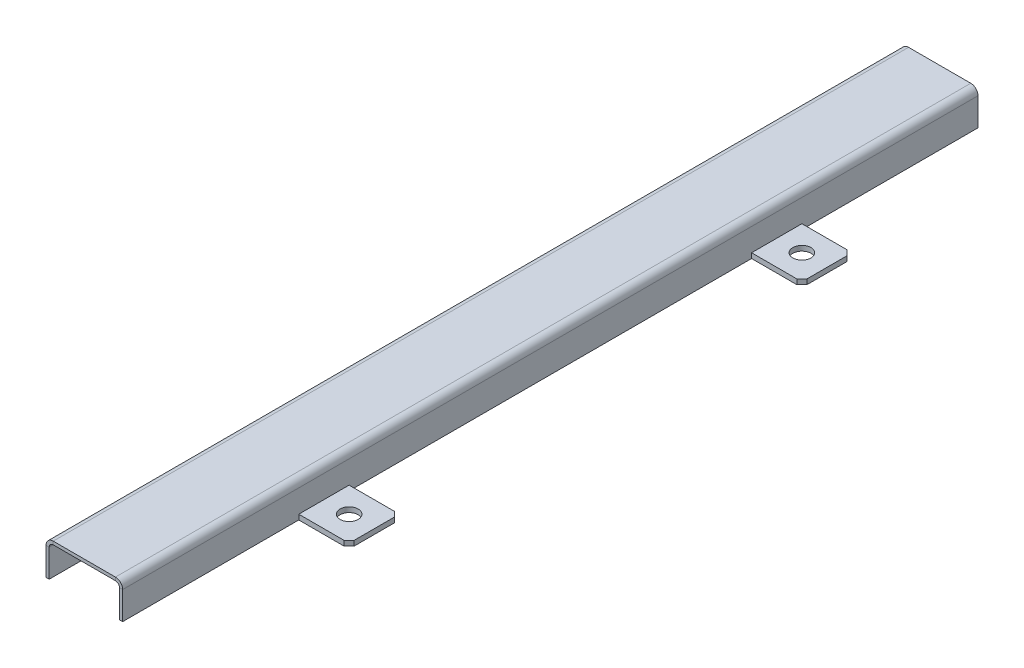
ISO-10303-21;
HEADER;
FILE_DESCRIPTION(('STEP AP214'),'2;1');
FILE_NAME('part.step','',(''),(''),'','','');
FILE_SCHEMA(('AUTOMOTIVE_DESIGN { 1 0 10303 214 1 1 1 1 }'));
ENDSEC;
DATA;
#1=APPLICATION_CONTEXT('core data for automotive mechanical design processes');
#2=APPLICATION_PROTOCOL_DEFINITION('international standard','automotive_design',2000,#1);
#3=PRODUCT_CONTEXT('',#1,'mechanical');
#4=PRODUCT('Part','Part','',(#3));
#5=PRODUCT_RELATED_PRODUCT_CATEGORY('part','',(#4));
#6=PRODUCT_DEFINITION_FORMATION('','',#4);
#7=PRODUCT_DEFINITION_CONTEXT('part definition',#1,'design');
#8=PRODUCT_DEFINITION('design','',#6,#7);
#9=PRODUCT_DEFINITION_SHAPE('','',#8);
#10=(LENGTH_UNIT() NAMED_UNIT(*) SI_UNIT(.MILLI.,.METRE.));
#11=(NAMED_UNIT(*) PLANE_ANGLE_UNIT() SI_UNIT($,.RADIAN.));
#12=(NAMED_UNIT(*) SI_UNIT($,.STERADIAN.) SOLID_ANGLE_UNIT());
#13=UNCERTAINTY_MEASURE_WITH_UNIT(LENGTH_MEASURE(1.E-05),#10,'distance_accuracy_value','');
#14=(GEOMETRIC_REPRESENTATION_CONTEXT(3) GLOBAL_UNCERTAINTY_ASSIGNED_CONTEXT((#13)) GLOBAL_UNIT_ASSIGNED_CONTEXT((#10,
#11,#12)) REPRESENTATION_CONTEXT('',''));
#15=CARTESIAN_POINT('',(0.,0.,0.));
#16=DIRECTION('',(0.,0.,1.));
#17=DIRECTION('',(1.,0.,0.));
#18=AXIS2_PLACEMENT_3D('',#15,#16,#17);
#19=CARTESIAN_POINT('',(140.,34.8,425.));
#20=DIRECTION('',(1.,0.,0.));
#21=DIRECTION('',(0.,0.,-1.));
#22=AXIS2_PLACEMENT_3D('',#19,#20,#21);
#23=PLANE('',#22);
#24=DIRECTION('',(0.,-1.,0.));
#25=VECTOR('',#24,1.);
#26=CARTESIAN_POINT('',(140.,0.,-250.));
#27=LINE('',#26,#25);
#28=CARTESIAN_POINT('',(140.,5.00000000000002,-250.));
#29=VERTEX_POINT('',#28);
#30=CARTESIAN_POINT('',(140.,0.,-250.));
#31=VERTEX_POINT('',#30);
#32=EDGE_CURVE('E219',#29,#31,#27,.T.);
#33=ORIENTED_EDGE('',*,*,#32,.T.);
#34=DIRECTION('',(0.,0.,-1.));
#35=VECTOR('',#34,1.);
#36=CARTESIAN_POINT('',(140.,0.,425.));
#37=LINE('',#36,#35);
#38=CARTESIAN_POINT('',(140.,0.,-425.));
#39=VERTEX_POINT('',#38);
#40=EDGE_CURVE('E226',#31,#39,#37,.T.);
#41=ORIENTED_EDGE('',*,*,#40,.T.);
#42=DIRECTION('',(0.,-1.,0.));
#43=VECTOR('',#42,1.);
#44=CARTESIAN_POINT('',(140.,34.8,-425.));
#45=LINE('',#44,#43);
#46=CARTESIAN_POINT('',(140.,27.625,-425.));
#47=VERTEX_POINT('',#46);
#48=EDGE_CURVE('E361',#47,#39,#45,.T.);
#49=ORIENTED_EDGE('',*,*,#48,.F.);
#50=DIRECTION('',(0.,0.,-1.));
#51=VECTOR('',#50,1.);
#52=CARTESIAN_POINT('',(140.,27.625,425.));
#53=LINE('',#52,#51);
#54=CARTESIAN_POINT('',(140.,27.625,425.));
#55=VERTEX_POINT('',#54);
#56=EDGE_CURVE('E235',#55,#47,#53,.T.);
#57=ORIENTED_EDGE('',*,*,#56,.F.);
#58=DIRECTION('',(0.,-1.,0.));
#59=VECTOR('',#58,1.);
#60=CARTESIAN_POINT('',(140.,34.8,425.));
#61=LINE('',#60,#59);
#62=CARTESIAN_POINT('',(140.,0.,425.));
#63=VERTEX_POINT('',#62);
#64=EDGE_CURVE('E315',#55,#63,#61,.T.);
#65=ORIENTED_EDGE('',*,*,#64,.T.);
#66=CARTESIAN_POINT('',(140.,0.,250.));
#67=VERTEX_POINT('',#66);
#68=EDGE_CURVE('E237',#63,#67,#37,.T.);
#69=ORIENTED_EDGE('',*,*,#68,.T.);
#70=DIRECTION('',(0.,-1.,0.));
#71=VECTOR('',#70,1.);
#72=CARTESIAN_POINT('',(140.,0.,250.));
#73=LINE('',#72,#71);
#74=CARTESIAN_POINT('',(140.,5.00000000000001,250.));
#75=VERTEX_POINT('',#74);
#76=EDGE_CURVE('E274',#75,#67,#73,.T.);
#77=ORIENTED_EDGE('',*,*,#76,.F.);
#78=DIRECTION('',(0.,0.,1.));
#79=VECTOR('',#78,1.);
#80=CARTESIAN_POINT('',(140.,5.00000000000001,250.));
#81=LINE('',#80,#79);
#82=CARTESIAN_POINT('',(140.,5.00000000000002,200.));
#83=VERTEX_POINT('',#82);
#84=EDGE_CURVE('E280',#83,#75,#81,.T.);
#85=ORIENTED_EDGE('',*,*,#84,.F.);
#86=DIRECTION('',(0.,1.,0.));
#87=VECTOR('',#86,1.);
#88=CARTESIAN_POINT('',(140.,0.,200.));
#89=LINE('',#88,#87);
#90=CARTESIAN_POINT('',(140.,0.,200.));
#91=VERTEX_POINT('',#90);
#92=EDGE_CURVE('E288',#91,#83,#89,.T.);
#93=ORIENTED_EDGE('',*,*,#92,.F.);
#94=CARTESIAN_POINT('',(140.,0.,-200.));
#95=VERTEX_POINT('',#94);
#96=EDGE_CURVE('E234',#91,#95,#37,.T.);
#97=ORIENTED_EDGE('',*,*,#96,.T.);
#98=DIRECTION('',(0.,1.,0.));
#99=VECTOR('',#98,1.);
#100=CARTESIAN_POINT('',(140.,0.,-200.));
#101=LINE('',#100,#99);
#102=CARTESIAN_POINT('',(140.,5.00000000000002,-200.));
#103=VERTEX_POINT('',#102);
#104=EDGE_CURVE('E247',#95,#103,#101,.T.);
#105=ORIENTED_EDGE('',*,*,#104,.T.);
#106=DIRECTION('',(0.,0.,-1.));
#107=VECTOR('',#106,1.);
#108=CARTESIAN_POINT('',(140.,5.00000000000001,-250.));
#109=LINE('',#108,#107);
#110=EDGE_CURVE('E241',#103,#29,#109,.T.);
#111=ORIENTED_EDGE('',*,*,#110,.T.);
#112=EDGE_LOOP('',(#33,#41,#49,#57,#65,#69,#77,#85,#93,#97,#105,#111));
#113=FACE_BOUND('',#112,.T.);
#114=ADVANCED_FACE('F49',(#113),#23,.T.);
#115=CARTESIAN_POINT('',(70.975,34.8,425.));
#116=DIRECTION('',(0.,0.,1.));
#117=DIRECTION('',(1.,0.,0.));
#118=AXIS2_PLACEMENT_3D('',#115,#116,#117);
#119=PLANE('',#118);
#120=DIRECTION('',(0.,-1.,0.));
#121=VECTOR('',#120,1.);
#122=CARTESIAN_POINT('',(70.975,34.8,425.));
#123=LINE('',#122,#121);
#124=CARTESIAN_POINT('',(70.975,34.8,425.));
#125=VERTEX_POINT('',#124);
#126=CARTESIAN_POINT('',(70.975,31.625,425.));
#127=VERTEX_POINT('',#126);
#128=EDGE_CURVE('E461',#125,#127,#123,.T.);
#129=ORIENTED_EDGE('',*,*,#128,.F.);
#130=CARTESIAN_POINT('',(70.975,27.625,425.));
#131=DIRECTION('',(0.,0.,1.));
#132=DIRECTION('',(1.,0.,0.));
#133=AXIS2_PLACEMENT_3D('',#130,#131,#132);
#134=CIRCLE('',#133,7.175);
#135=CARTESIAN_POINT('',(63.8,27.625,425.));
#136=VERTEX_POINT('',#135);
#137=EDGE_CURVE('E327',#136,#125,#134,.F.);
#138=ORIENTED_EDGE('',*,*,#137,.F.);
#139=DIRECTION('',(-1.,0.,0.));
#140=VECTOR('',#139,1.);
#141=CARTESIAN_POINT('',(66.975,27.625,425.));
#142=LINE('',#141,#140);
#143=CARTESIAN_POINT('',(66.975,27.625,425.));
#144=VERTEX_POINT('',#143);
#145=EDGE_CURVE('E458',#144,#136,#142,.T.);
#146=ORIENTED_EDGE('',*,*,#145,.F.);
#147=CARTESIAN_POINT('',(70.975,27.625,425.));
#148=DIRECTION('',(0.,0.,1.));
#149=DIRECTION('',(1.,0.,0.));
#150=AXIS2_PLACEMENT_3D('',#147,#148,#149);
#151=CIRCLE('',#150,4.);
#152=EDGE_CURVE('E343',#144,#127,#151,.F.);
#153=ORIENTED_EDGE('',*,*,#152,.T.);
#154=EDGE_LOOP('',(#129,#138,#146,#153));
#155=FACE_BOUND('',#154,.T.);
#156=ADVANCED_FACE('F541',(#155),#119,.T.);
#157=CARTESIAN_POINT('',(66.975,27.625,425.));
#158=DIRECTION('',(0.,0.,1.));
#159=DIRECTION('',(1.,0.,0.));
#160=AXIS2_PLACEMENT_3D('',#157,#158,#159);
#161=PLANE('',#160);
#162=DIRECTION('',(1.,0.,0.));
#163=VECTOR('',#162,1.);
#164=CARTESIAN_POINT('',(63.8,34.8,425.));
#165=LINE('',#164,#163);
#166=CARTESIAN_POINT('',(132.825,34.8,425.));
#167=VERTEX_POINT('',#166);
#168=EDGE_CURVE('E323',#125,#167,#165,.T.);
#169=ORIENTED_EDGE('',*,*,#168,.F.);
#170=ORIENTED_EDGE('',*,*,#128,.T.);
#171=DIRECTION('',(1.,0.,0.));
#172=VECTOR('',#171,1.);
#173=CARTESIAN_POINT('',(63.8,31.625,425.));
#174=LINE('',#173,#172);
#175=CARTESIAN_POINT('',(132.825,31.625,425.));
#176=VERTEX_POINT('',#175);
#177=EDGE_CURVE('E347',#127,#176,#174,.T.);
#178=ORIENTED_EDGE('',*,*,#177,.T.);
#179=DIRECTION('',(0.,1.,0.));
#180=VECTOR('',#179,1.);
#181=CARTESIAN_POINT('',(132.825,31.625,425.));
#182=LINE('',#181,#180);
#183=EDGE_CURVE('E446',#176,#167,#182,.T.);
#184=ORIENTED_EDGE('',*,*,#183,.T.);
#185=EDGE_LOOP('',(#169,#170,#178,#184));
#186=FACE_BOUND('',#185,.T.);
#187=ADVANCED_FACE('F546',(#186),#161,.T.);
#188=CARTESIAN_POINT('',(63.8,27.625,-425.));
#189=DIRECTION('',(0.,0.,-1.));
#190=DIRECTION('',(-1.,0.,0.));
#191=AXIS2_PLACEMENT_3D('',#188,#189,#190);
#192=PLANE('',#191);
#193=DIRECTION('',(1.,0.,0.));
#194=VECTOR('',#193,1.);
#195=CARTESIAN_POINT('',(63.8,27.625,-425.));
#196=LINE('',#195,#194);
#197=CARTESIAN_POINT('',(63.8,27.625,-425.));
#198=VERTEX_POINT('',#197);
#199=CARTESIAN_POINT('',(66.975,27.625,-425.));
#200=VERTEX_POINT('',#199);
#201=EDGE_CURVE('E455',#198,#200,#196,.T.);
#202=ORIENTED_EDGE('',*,*,#201,.F.);
#203=CARTESIAN_POINT('',(70.975,27.625,-425.));
#204=DIRECTION('',(0.,0.,1.));
#205=DIRECTION('',(1.,0.,0.));
#206=AXIS2_PLACEMENT_3D('',#203,#204,#205);
#207=CIRCLE('',#206,7.175);
#208=CARTESIAN_POINT('',(70.975,34.8,-425.));
#209=VERTEX_POINT('',#208);
#210=EDGE_CURVE('E372',#198,#209,#207,.F.);
#211=ORIENTED_EDGE('',*,*,#210,.T.);
#212=DIRECTION('',(0.,1.,0.));
#213=VECTOR('',#212,1.);
#214=CARTESIAN_POINT('',(70.975,31.625,-425.));
#215=LINE('',#214,#213);
#216=CARTESIAN_POINT('',(70.975,31.625,-425.));
#217=VERTEX_POINT('',#216);
#218=EDGE_CURVE('E452',#217,#209,#215,.T.);
#219=ORIENTED_EDGE('',*,*,#218,.F.);
#220=CARTESIAN_POINT('',(70.975,27.625,-425.));
#221=DIRECTION('',(0.,0.,1.));
#222=DIRECTION('',(1.,0.,0.));
#223=AXIS2_PLACEMENT_3D('',#220,#221,#222);
#224=CIRCLE('',#223,4.);
#225=EDGE_CURVE('E388',#200,#217,#224,.F.);
#226=ORIENTED_EDGE('',*,*,#225,.F.);
#227=EDGE_LOOP('',(#202,#211,#219,#226));
#228=FACE_BOUND('',#227,.T.);
#229=ADVANCED_FACE('F579',(#228),#192,.T.);
#230=CARTESIAN_POINT('',(70.975,31.625,-425.));
#231=DIRECTION('',(0.,0.,-1.));
#232=DIRECTION('',(-1.,0.,0.));
#233=AXIS2_PLACEMENT_3D('',#230,#231,#232);
#234=PLANE('',#233);
#235=DIRECTION('',(0.,1.,0.));
#236=VECTOR('',#235,1.);
#237=CARTESIAN_POINT('',(63.8,0.,-425.));
#238=LINE('',#237,#236);
#239=CARTESIAN_POINT('',(63.8,0.,-425.));
#240=VERTEX_POINT('',#239);
#241=EDGE_CURVE('E376',#240,#198,#238,.T.);
#242=ORIENTED_EDGE('',*,*,#241,.T.);
#243=ORIENTED_EDGE('',*,*,#201,.T.);
#244=DIRECTION('',(0.,1.,0.));
#245=VECTOR('',#244,1.);
#246=CARTESIAN_POINT('',(66.975,0.,-425.));
#247=LINE('',#246,#245);
#248=CARTESIAN_POINT('',(66.975,0.,-425.));
#249=VERTEX_POINT('',#248);
#250=EDGE_CURVE('E384',#249,#200,#247,.T.);
#251=ORIENTED_EDGE('',*,*,#250,.F.);
#252=DIRECTION('',(-1.,0.,0.));
#253=VECTOR('',#252,1.);
#254=CARTESIAN_POINT('',(66.975,0.,-425.));
#255=LINE('',#254,#253);
#256=EDGE_CURVE('E380',#249,#240,#255,.T.);
#257=ORIENTED_EDGE('',*,*,#256,.T.);
#258=EDGE_LOOP('',(#242,#243,#251,#257));
#259=FACE_BOUND('',#258,.T.);
#260=ADVANCED_FACE('F575',(#259),#234,.T.);
#261=CARTESIAN_POINT('',(140.,27.625,425.));
#262=DIRECTION('',(0.,0.,1.));
#263=DIRECTION('',(1.,0.,0.));
#264=AXIS2_PLACEMENT_3D('',#261,#262,#263);
#265=PLANE('',#264);
#266=DIRECTION('',(-1.,0.,0.));
#267=VECTOR('',#266,1.);
#268=CARTESIAN_POINT('',(140.,27.625,425.));
#269=LINE('',#268,#267);
#270=CARTESIAN_POINT('',(136.825,27.625,425.));
#271=VERTEX_POINT('',#270);
#272=EDGE_CURVE('E449',#55,#271,#269,.T.);
#273=ORIENTED_EDGE('',*,*,#272,.F.);
#274=CARTESIAN_POINT('',(132.825,27.625,425.));
#275=DIRECTION('',(0.,0.,1.));
#276=DIRECTION('',(1.,0.,0.));
#277=AXIS2_PLACEMENT_3D('',#274,#275,#276);
#278=CIRCLE('',#277,7.175);
#279=EDGE_CURVE('E319',#167,#55,#278,.F.);
#280=ORIENTED_EDGE('',*,*,#279,.F.);
#281=ORIENTED_EDGE('',*,*,#183,.F.);
#282=CARTESIAN_POINT('',(132.825,27.625,425.));
#283=DIRECTION('',(0.,0.,1.));
#284=DIRECTION('',(1.,0.,0.));
#285=AXIS2_PLACEMENT_3D('',#282,#283,#284);
#286=CIRCLE('',#285,4.);
#287=EDGE_CURVE('E351',#176,#271,#286,.F.);
#288=ORIENTED_EDGE('',*,*,#287,.T.);
#289=EDGE_LOOP('',(#273,#280,#281,#288));
#290=FACE_BOUND('',#289,.T.);
#291=ADVANCED_FACE('F571',(#290),#265,.T.);
#292=CARTESIAN_POINT('',(132.825,31.625,425.));
#293=DIRECTION('',(0.,0.,1.));
#294=DIRECTION('',(1.,0.,0.));
#295=AXIS2_PLACEMENT_3D('',#292,#293,#294);
#296=PLANE('',#295);
#297=ORIENTED_EDGE('',*,*,#64,.F.);
#298=ORIENTED_EDGE('',*,*,#272,.T.);
#299=DIRECTION('',(0.,1.,0.));
#300=VECTOR('',#299,1.);
#301=CARTESIAN_POINT('',(136.825,34.8,425.));
#302=LINE('',#301,#300);
#303=CARTESIAN_POINT('',(136.825,0.,425.));
#304=VERTEX_POINT('',#303);
#305=EDGE_CURVE('E307',#271,#304,#302,.F.);
#306=ORIENTED_EDGE('',*,*,#305,.T.);
#307=DIRECTION('',(-1.,0.,0.));
#308=VECTOR('',#307,1.);
#309=CARTESIAN_POINT('',(140.,0.,425.));
#310=LINE('',#309,#308);
#311=EDGE_CURVE('E310',#63,#304,#310,.T.);
#312=ORIENTED_EDGE('',*,*,#311,.F.);
#313=EDGE_LOOP('',(#297,#298,#306,#312));
#314=FACE_BOUND('',#313,.T.);
#315=ADVANCED_FACE('F567',(#314),#296,.T.);
#316=CARTESIAN_POINT('',(132.825,34.8,-425.));
#317=DIRECTION('',(0.,0.,-1.));
#318=DIRECTION('',(-1.,0.,0.));
#319=AXIS2_PLACEMENT_3D('',#316,#317,#318);
#320=PLANE('',#319);
#321=DIRECTION('',(0.,-1.,0.));
#322=VECTOR('',#321,1.);
#323=CARTESIAN_POINT('',(132.825,34.8,-425.));
#324=LINE('',#323,#322);
#325=CARTESIAN_POINT('',(132.825,34.8,-425.));
#326=VERTEX_POINT('',#325);
#327=CARTESIAN_POINT('',(132.825,31.625,-425.));
#328=VERTEX_POINT('',#327);
#329=EDGE_CURVE('E443',#326,#328,#324,.T.);
#330=ORIENTED_EDGE('',*,*,#329,.F.);
#331=CARTESIAN_POINT('',(132.825,27.625,-425.));
#332=DIRECTION('',(0.,0.,1.));
#333=DIRECTION('',(1.,0.,0.));
#334=AXIS2_PLACEMENT_3D('',#331,#332,#333);
#335=CIRCLE('',#334,7.175);
#336=EDGE_CURVE('E364',#326,#47,#335,.F.);
#337=ORIENTED_EDGE('',*,*,#336,.T.);
#338=DIRECTION('',(1.,0.,0.));
#339=VECTOR('',#338,1.);
#340=CARTESIAN_POINT('',(136.825,27.625,-425.));
#341=LINE('',#340,#339);
#342=CARTESIAN_POINT('',(136.825,27.625,-425.));
#343=VERTEX_POINT('',#342);
#344=EDGE_CURVE('E440',#343,#47,#341,.T.);
#345=ORIENTED_EDGE('',*,*,#344,.F.);
#346=CARTESIAN_POINT('',(132.825,27.625,-425.));
#347=DIRECTION('',(0.,0.,1.));
#348=DIRECTION('',(1.,0.,0.));
#349=AXIS2_PLACEMENT_3D('',#346,#347,#348);
#350=CIRCLE('',#349,4.);
#351=EDGE_CURVE('E311',#328,#343,#350,.F.);
#352=ORIENTED_EDGE('',*,*,#351,.F.);
#353=EDGE_LOOP('',(#330,#337,#345,#352));
#354=FACE_BOUND('',#353,.T.);
#355=ADVANCED_FACE('F563',(#354),#320,.T.);
#356=CARTESIAN_POINT('',(136.825,27.625,-425.));
#357=DIRECTION('',(0.,0.,-1.));
#358=DIRECTION('',(-1.,0.,0.));
#359=AXIS2_PLACEMENT_3D('',#356,#357,#358);
#360=PLANE('',#359);
#361=DIRECTION('',(1.,0.,0.));
#362=VECTOR('',#361,1.);
#363=CARTESIAN_POINT('',(63.8,34.8,-425.));
#364=LINE('',#363,#362);
#365=EDGE_CURVE('E368',#209,#326,#364,.T.);
#366=ORIENTED_EDGE('',*,*,#365,.T.);
#367=ORIENTED_EDGE('',*,*,#329,.T.);
#368=DIRECTION('',(1.,0.,0.));
#369=VECTOR('',#368,1.);
#370=CARTESIAN_POINT('',(63.8,31.625,-425.));
#371=LINE('',#370,#369);
#372=EDGE_CURVE('E392',#217,#328,#371,.T.);
#373=ORIENTED_EDGE('',*,*,#372,.F.);
#374=ORIENTED_EDGE('',*,*,#218,.T.);
#375=EDGE_LOOP('',(#366,#367,#373,#374));
#376=FACE_BOUND('',#375,.T.);
#377=ADVANCED_FACE('F559',(#376),#360,.T.);
#378=CARTESIAN_POINT('',(136.825,34.8,425.));
#379=DIRECTION('',(1.,0.,0.));
#380=DIRECTION('',(0.,0.,-1.));
#381=AXIS2_PLACEMENT_3D('',#378,#379,#380);
#382=PLANE('',#381);
#383=DIRECTION('',(0.,1.,0.));
#384=VECTOR('',#383,1.);
#385=CARTESIAN_POINT('',(136.825,34.8,-425.));
#386=LINE('',#385,#384);
#387=CARTESIAN_POINT('',(136.825,0.,-425.));
#388=VERTEX_POINT('',#387);
#389=EDGE_CURVE('E306',#343,#388,#386,.F.);
#390=ORIENTED_EDGE('',*,*,#389,.T.);
#391=DIRECTION('',(0.,0.,-1.));
#392=VECTOR('',#391,1.);
#393=CARTESIAN_POINT('',(136.825,0.,425.));
#394=LINE('',#393,#392);
#395=EDGE_CURVE('E437',#304,#388,#394,.T.);
#396=ORIENTED_EDGE('',*,*,#395,.F.);
#397=ORIENTED_EDGE('',*,*,#305,.F.);
#398=DIRECTION('',(0.,0.,-1.));
#399=VECTOR('',#398,1.);
#400=CARTESIAN_POINT('',(136.825,27.625,425.));
#401=LINE('',#400,#399);
#402=EDGE_CURVE('E355',#271,#343,#401,.T.);
#403=ORIENTED_EDGE('',*,*,#402,.T.);
#404=EDGE_LOOP('',(#390,#396,#397,#403));
#405=FACE_BOUND('',#404,.T.);
#406=ADVANCED_FACE('F555',(#405),#382,.F.);
#407=CARTESIAN_POINT('',(140.,0.,425.));
#408=DIRECTION('',(0.,-1.,0.));
#409=DIRECTION('',(0.,0.,-1.));
#410=AXIS2_PLACEMENT_3D('',#407,#408,#409);
#411=PLANE('',#410);
#412=CARTESIAN_POINT('',(165.,0.,-225.));
#413=DIRECTION('',(0.,-1.,0.));
#414=DIRECTION('',(0.,0.,-1.));
#415=AXIS2_PLACEMENT_3D('',#412,#413,#414);
#416=CIRCLE('',#415,9.00000000000001);
#417=CARTESIAN_POINT('',(165.,0.,-234.));
#418=VERTEX_POINT('',#417);
#419=EDGE_CURVE('E243',#418,#418,#416,.F.);
#420=ORIENTED_EDGE('',*,*,#419,.T.);
#421=EDGE_LOOP('',(#420));
#422=FACE_BOUND('',#421,.T.);
#423=CARTESIAN_POINT('',(165.,0.,225.));
#424=DIRECTION('',(0.,-1.,0.));
#425=DIRECTION('',(0.,0.,-1.));
#426=AXIS2_PLACEMENT_3D('',#423,#424,#425);
#427=CIRCLE('',#426,9.00000000000001);
#428=CARTESIAN_POINT('',(165.,0.,216.));
#429=VERTEX_POINT('',#428);
#430=EDGE_CURVE('E270',#429,#429,#427,.T.);
#431=ORIENTED_EDGE('',*,*,#430,.F.);
#432=EDGE_LOOP('',(#431));
#433=FACE_BOUND('',#432,.T.);
#434=DIRECTION('',(0.,0.,1.));
#435=VECTOR('',#434,1.);
#436=CARTESIAN_POINT('',(190.,0.,-250.));
#437=LINE('',#436,#435);
#438=CARTESIAN_POINT('',(190.,0.,-245.));
#439=VERTEX_POINT('',#438);
#440=CARTESIAN_POINT('',(190.,0.,-205.));
#441=VERTEX_POINT('',#440);
#442=EDGE_CURVE('E223',#439,#441,#437,.T.);
#443=ORIENTED_EDGE('',*,*,#442,.T.);
#444=DIRECTION('',(-0.707106781186548,0.,0.707106781186548));
#445=VECTOR('',#444,1.);
#446=CARTESIAN_POINT('',(-150.,0.,135.));
#447=LINE('',#446,#445);
#448=CARTESIAN_POINT('',(185.,0.,-200.));
#449=VERTEX_POINT('',#448);
#450=EDGE_CURVE('E59',#441,#449,#447,.T.);
#451=ORIENTED_EDGE('',*,*,#450,.T.);
#452=DIRECTION('',(-1.,0.,0.));
#453=VECTOR('',#452,1.);
#454=CARTESIAN_POINT('',(190.,0.,-200.));
#455=LINE('',#454,#453);
#456=EDGE_CURVE('E222',#449,#95,#455,.T.);
#457=ORIENTED_EDGE('',*,*,#456,.T.);
#458=ORIENTED_EDGE('',*,*,#96,.F.);
#459=DIRECTION('',(-1.,0.,0.));
#460=VECTOR('',#459,1.);
#461=CARTESIAN_POINT('',(190.,0.,200.));
#462=LINE('',#461,#460);
#463=CARTESIAN_POINT('',(185.,0.,200.));
#464=VERTEX_POINT('',#463);
#465=EDGE_CURVE('E300',#464,#91,#462,.T.);
#466=ORIENTED_EDGE('',*,*,#465,.F.);
#467=DIRECTION('',(-0.707106781186548,0.,-0.707106781186548));
#468=VECTOR('',#467,1.);
#469=CARTESIAN_POINT('',(275.,0.,290.));
#470=LINE('',#469,#468);
#471=CARTESIAN_POINT('',(190.,0.,205.));
#472=VERTEX_POINT('',#471);
#473=EDGE_CURVE('E484',#464,#472,#470,.F.);
#474=ORIENTED_EDGE('',*,*,#473,.T.);
#475=DIRECTION('',(0.,0.,-1.));
#476=VECTOR('',#475,1.);
#477=CARTESIAN_POINT('',(190.,0.,250.));
#478=LINE('',#477,#476);
#479=CARTESIAN_POINT('',(190.,0.,245.));
#480=VERTEX_POINT('',#479);
#481=EDGE_CURVE('E275',#480,#472,#478,.T.);
#482=ORIENTED_EDGE('',*,*,#481,.F.);
#483=DIRECTION('',(0.707106781186555,0.,-0.70710678118654));
#484=VECTOR('',#483,1.);
#485=CARTESIAN_POINT('',(74.9999999999994,0.,359.999999999998));
#486=LINE('',#485,#484);
#487=CARTESIAN_POINT('',(185.,0.,250.));
#488=VERTEX_POINT('',#487);
#489=EDGE_CURVE('E481',#480,#488,#486,.F.);
#490=ORIENTED_EDGE('',*,*,#489,.T.);
#491=DIRECTION('',(-1.,0.,0.));
#492=VECTOR('',#491,1.);
#493=CARTESIAN_POINT('',(190.,0.,250.));
#494=LINE('',#493,#492);
#495=EDGE_CURVE('E303',#488,#67,#494,.T.);
#496=ORIENTED_EDGE('',*,*,#495,.T.);
#497=ORIENTED_EDGE('',*,*,#68,.F.);
#498=ORIENTED_EDGE('',*,*,#311,.T.);
#499=ORIENTED_EDGE('',*,*,#395,.T.);
#500=DIRECTION('',(-1.,0.,0.));
#501=VECTOR('',#500,1.);
#502=CARTESIAN_POINT('',(140.,0.,-425.));
#503=LINE('',#502,#501);
#504=EDGE_CURVE('E229',#39,#388,#503,.T.);
#505=ORIENTED_EDGE('',*,*,#504,.F.);
#506=ORIENTED_EDGE('',*,*,#40,.F.);
#507=DIRECTION('',(-1.,0.,0.));
#508=VECTOR('',#507,1.);
#509=CARTESIAN_POINT('',(190.,0.,-250.));
#510=LINE('',#509,#508);
#511=CARTESIAN_POINT('',(185.,0.,-250.));
#512=VERTEX_POINT('',#511);
#513=EDGE_CURVE('E214',#512,#31,#510,.T.);
#514=ORIENTED_EDGE('',*,*,#513,.F.);
#515=DIRECTION('',(0.707106781186555,0.,0.70710678118654));
#516=VECTOR('',#515,1.);
#517=CARTESIAN_POINT('',(499.999999999999,0.,64.9999999999927));
#518=LINE('',#517,#516);
#519=EDGE_CURVE('E66',#512,#439,#518,.T.);
#520=ORIENTED_EDGE('',*,*,#519,.T.);
#521=EDGE_LOOP('',(#443,#451,#457,#458,#466,#474,#482,#490,#496,#497,#498,#499,#505,#506,#514,#520));
#522=FACE_BOUND('',#521,.T.);
#523=ADVANCED_FACE('F227',(#422,#433,#522),#411,.T.);
#524=CARTESIAN_POINT('',(132.825,27.625,425.));
#525=DIRECTION('',(0.,0.,-1.));
#526=DIRECTION('',(-1.,0.,0.));
#527=AXIS2_PLACEMENT_3D('',#524,#525,#526);
#528=CYLINDRICAL_SURFACE('',#527,7.175);
#529=ORIENTED_EDGE('',*,*,#336,.F.);
#530=DIRECTION('',(0.,0.,-1.));
#531=VECTOR('',#530,1.);
#532=CARTESIAN_POINT('',(132.825,34.8,425.));
#533=LINE('',#532,#531);
#534=EDGE_CURVE('E428',#167,#326,#533,.T.);
#535=ORIENTED_EDGE('',*,*,#534,.F.);
#536=ORIENTED_EDGE('',*,*,#279,.T.);
#537=ORIENTED_EDGE('',*,*,#56,.T.);
#538=EDGE_LOOP('',(#529,#535,#536,#537));
#539=FACE_BOUND('',#538,.T.);
#540=ADVANCED_FACE('F551',(#539),#528,.T.);
#541=CARTESIAN_POINT('',(63.8,34.8,425.));
#542=DIRECTION('',(0.,1.,0.));
#543=DIRECTION('',(-1.,0.,0.));
#544=AXIS2_PLACEMENT_3D('',#541,#542,#543);
#545=PLANE('',#544);
#546=ORIENTED_EDGE('',*,*,#365,.F.);
#547=DIRECTION('',(0.,0.,-1.));
#548=VECTOR('',#547,1.);
#549=CARTESIAN_POINT('',(70.975,34.8,425.));
#550=LINE('',#549,#548);
#551=EDGE_CURVE('E424',#125,#209,#550,.T.);
#552=ORIENTED_EDGE('',*,*,#551,.F.);
#553=ORIENTED_EDGE('',*,*,#168,.T.);
#554=ORIENTED_EDGE('',*,*,#534,.T.);
#555=EDGE_LOOP('',(#546,#552,#553,#554));
#556=FACE_BOUND('',#555,.T.);
#557=ADVANCED_FACE('F670',(#556),#545,.T.);
#558=CARTESIAN_POINT('',(70.975,27.625,425.));
#559=DIRECTION('',(0.,0.,-1.));
#560=DIRECTION('',(-1.,0.,0.));
#561=AXIS2_PLACEMENT_3D('',#558,#559,#560);
#562=CYLINDRICAL_SURFACE('',#561,7.175);
#563=ORIENTED_EDGE('',*,*,#210,.F.);
#564=DIRECTION('',(0.,0.,-1.));
#565=VECTOR('',#564,1.);
#566=CARTESIAN_POINT('',(63.8,27.625,425.));
#567=LINE('',#566,#565);
#568=EDGE_CURVE('E420',#136,#198,#567,.T.);
#569=ORIENTED_EDGE('',*,*,#568,.F.);
#570=ORIENTED_EDGE('',*,*,#137,.T.);
#571=ORIENTED_EDGE('',*,*,#551,.T.);
#572=EDGE_LOOP('',(#563,#569,#570,#571));
#573=FACE_BOUND('',#572,.T.);
#574=ADVANCED_FACE('F667',(#573),#562,.T.);
#575=CARTESIAN_POINT('',(63.8,0.,425.));
#576=DIRECTION('',(-1.,0.,0.));
#577=DIRECTION('',(0.,0.,1.));
#578=AXIS2_PLACEMENT_3D('',#575,#576,#577);
#579=PLANE('',#578);
#580=ORIENTED_EDGE('',*,*,#241,.F.);
#581=DIRECTION('',(0.,0.,-1.));
#582=VECTOR('',#581,1.);
#583=CARTESIAN_POINT('',(63.8,0.,425.));
#584=LINE('',#583,#582);
#585=CARTESIAN_POINT('',(63.8,0.,425.));
#586=VERTEX_POINT('',#585);
#587=EDGE_CURVE('E417',#586,#240,#584,.T.);
#588=ORIENTED_EDGE('',*,*,#587,.F.);
#589=DIRECTION('',(0.,1.,0.));
#590=VECTOR('',#589,1.);
#591=CARTESIAN_POINT('',(63.8,0.,425.));
#592=LINE('',#591,#590);
#593=EDGE_CURVE('E331',#586,#136,#592,.T.);
#594=ORIENTED_EDGE('',*,*,#593,.T.);
#595=ORIENTED_EDGE('',*,*,#568,.T.);
#596=EDGE_LOOP('',(#580,#588,#594,#595));
#597=FACE_BOUND('',#596,.T.);
#598=ADVANCED_FACE('F663',(#597),#579,.T.);
#599=CARTESIAN_POINT('',(66.975,0.,425.));
#600=DIRECTION('',(0.,-1.,0.));
#601=DIRECTION('',(0.,0.,-1.));
#602=AXIS2_PLACEMENT_3D('',#599,#600,#601);
#603=PLANE('',#602);
#604=ORIENTED_EDGE('',*,*,#256,.F.);
#605=DIRECTION('',(0.,0.,-1.));
#606=VECTOR('',#605,1.);
#607=CARTESIAN_POINT('',(66.975,0.,425.));
#608=LINE('',#607,#606);
#609=CARTESIAN_POINT('',(66.975,0.,425.));
#610=VERTEX_POINT('',#609);
#611=EDGE_CURVE('E414',#610,#249,#608,.T.);
#612=ORIENTED_EDGE('',*,*,#611,.F.);
#613=DIRECTION('',(-1.,0.,0.));
#614=VECTOR('',#613,1.);
#615=CARTESIAN_POINT('',(66.975,0.,425.));
#616=LINE('',#615,#614);
#617=EDGE_CURVE('E335',#610,#586,#616,.T.);
#618=ORIENTED_EDGE('',*,*,#617,.T.);
#619=ORIENTED_EDGE('',*,*,#587,.T.);
#620=EDGE_LOOP('',(#604,#612,#618,#619));
#621=FACE_BOUND('',#620,.T.);
#622=ADVANCED_FACE('F659',(#621),#603,.T.);
#623=CARTESIAN_POINT('',(66.975,0.,425.));
#624=DIRECTION('',(-1.,0.,0.));
#625=DIRECTION('',(0.,0.,1.));
#626=AXIS2_PLACEMENT_3D('',#623,#624,#625);
#627=PLANE('',#626);
#628=ORIENTED_EDGE('',*,*,#250,.T.);
#629=DIRECTION('',(0.,0.,-1.));
#630=VECTOR('',#629,1.);
#631=CARTESIAN_POINT('',(66.975,27.625,425.));
#632=LINE('',#631,#630);
#633=EDGE_CURVE('E410',#144,#200,#632,.T.);
#634=ORIENTED_EDGE('',*,*,#633,.F.);
#635=DIRECTION('',(0.,1.,0.));
#636=VECTOR('',#635,1.);
#637=CARTESIAN_POINT('',(66.975,0.,425.));
#638=LINE('',#637,#636);
#639=EDGE_CURVE('E339',#610,#144,#638,.T.);
#640=ORIENTED_EDGE('',*,*,#639,.F.);
#641=ORIENTED_EDGE('',*,*,#611,.T.);
#642=EDGE_LOOP('',(#628,#634,#640,#641));
#643=FACE_BOUND('',#642,.T.);
#644=ADVANCED_FACE('F655',(#643),#627,.F.);
#645=CARTESIAN_POINT('',(70.975,27.625,425.));
#646=DIRECTION('',(0.,0.,-1.));
#647=DIRECTION('',(-1.,0.,0.));
#648=AXIS2_PLACEMENT_3D('',#645,#646,#647);
#649=CYLINDRICAL_SURFACE('',#648,4.);
#650=ORIENTED_EDGE('',*,*,#225,.T.);
#651=DIRECTION('',(0.,0.,-1.));
#652=VECTOR('',#651,1.);
#653=CARTESIAN_POINT('',(70.975,31.625,425.));
#654=LINE('',#653,#652);
#655=EDGE_CURVE('E406',#127,#217,#654,.T.);
#656=ORIENTED_EDGE('',*,*,#655,.F.);
#657=ORIENTED_EDGE('',*,*,#152,.F.);
#658=ORIENTED_EDGE('',*,*,#633,.T.);
#659=EDGE_LOOP('',(#650,#656,#657,#658));
#660=FACE_BOUND('',#659,.T.);
#661=ADVANCED_FACE('F651',(#660),#649,.F.);
#662=CARTESIAN_POINT('',(63.8,31.625,425.));
#663=DIRECTION('',(0.,1.,0.));
#664=DIRECTION('',(-1.,0.,0.));
#665=AXIS2_PLACEMENT_3D('',#662,#663,#664);
#666=PLANE('',#665);
#667=ORIENTED_EDGE('',*,*,#372,.T.);
#668=DIRECTION('',(0.,0.,-1.));
#669=VECTOR('',#668,1.);
#670=CARTESIAN_POINT('',(132.825,31.625,425.));
#671=LINE('',#670,#669);
#672=EDGE_CURVE('E402',#176,#328,#671,.T.);
#673=ORIENTED_EDGE('',*,*,#672,.F.);
#674=ORIENTED_EDGE('',*,*,#177,.F.);
#675=ORIENTED_EDGE('',*,*,#655,.T.);
#676=EDGE_LOOP('',(#667,#673,#674,#675));
#677=FACE_BOUND('',#676,.T.);
#678=ADVANCED_FACE('F647',(#677),#666,.F.);
#679=CARTESIAN_POINT('',(132.825,27.625,425.));
#680=DIRECTION('',(0.,0.,-1.));
#681=DIRECTION('',(-1.,0.,0.));
#682=AXIS2_PLACEMENT_3D('',#679,#680,#681);
#683=CYLINDRICAL_SURFACE('',#682,4.);
#684=ORIENTED_EDGE('',*,*,#351,.T.);
#685=ORIENTED_EDGE('',*,*,#402,.F.);
#686=ORIENTED_EDGE('',*,*,#287,.F.);
#687=ORIENTED_EDGE('',*,*,#672,.T.);
#688=EDGE_LOOP('',(#684,#685,#686,#687));
#689=FACE_BOUND('',#688,.T.);
#690=ADVANCED_FACE('F640',(#689),#683,.F.);
#691=CARTESIAN_POINT('',(132.825,27.625,425.));
#692=DIRECTION('',(0.,0.,1.));
#693=DIRECTION('',(1.,0.,0.));
#694=AXIS2_PLACEMENT_3D('',#691,#692,#693);
#695=PLANE('',#694);
#696=ORIENTED_EDGE('',*,*,#639,.T.);
#697=ORIENTED_EDGE('',*,*,#145,.T.);
#698=ORIENTED_EDGE('',*,*,#593,.F.);
#699=ORIENTED_EDGE('',*,*,#617,.F.);
#700=EDGE_LOOP('',(#696,#697,#698,#699));
#701=FACE_BOUND('',#700,.T.);
#702=ADVANCED_FACE('F637',(#701),#695,.T.);
#703=CARTESIAN_POINT('',(132.825,27.625,-425.));
#704=DIRECTION('',(0.,0.,1.));
#705=DIRECTION('',(1.,0.,0.));
#706=AXIS2_PLACEMENT_3D('',#703,#704,#705);
#707=PLANE('',#706);
#708=ORIENTED_EDGE('',*,*,#389,.F.);
#709=ORIENTED_EDGE('',*,*,#344,.T.);
#710=ORIENTED_EDGE('',*,*,#48,.T.);
#711=ORIENTED_EDGE('',*,*,#504,.T.);
#712=EDGE_LOOP('',(#708,#709,#710,#711));
#713=FACE_BOUND('',#712,.T.);
#714=ADVANCED_FACE('F635',(#713),#707,.F.);
#715=CARTESIAN_POINT('',(190.,0.,250.));
#716=DIRECTION('',(0.,0.,-1.));
#717=DIRECTION('',(-1.,0.,0.));
#718=AXIS2_PLACEMENT_3D('',#715,#716,#717);
#719=PLANE('',#718);
#720=ORIENTED_EDGE('',*,*,#495,.F.);
#721=DIRECTION('',(0.,1.,0.));
#722=VECTOR('',#721,1.);
#723=CARTESIAN_POINT('',(185.,0.,250.));
#724=LINE('',#723,#722);
#725=CARTESIAN_POINT('',(185.,5.00000000000001,250.));
#726=VERTEX_POINT('',#725);
#727=EDGE_CURVE('E487',#488,#726,#724,.T.);
#728=ORIENTED_EDGE('',*,*,#727,.T.);
#729=DIRECTION('',(-1.,0.,0.));
#730=VECTOR('',#729,1.);
#731=CARTESIAN_POINT('',(190.,5.00000000000001,250.));
#732=LINE('',#731,#730);
#733=EDGE_CURVE('E284',#726,#75,#732,.T.);
#734=ORIENTED_EDGE('',*,*,#733,.T.);
#735=ORIENTED_EDGE('',*,*,#76,.T.);
#736=EDGE_LOOP('',(#720,#728,#734,#735));
#737=FACE_BOUND('',#736,.T.);
#738=ADVANCED_FACE('F631',(#737),#719,.F.);
#739=CARTESIAN_POINT('',(190.,0.,200.));
#740=DIRECTION('',(0.,0.,1.));
#741=DIRECTION('',(0.,-1.,0.));
#742=AXIS2_PLACEMENT_3D('',#739,#740,#741);
#743=PLANE('',#742);
#744=DIRECTION('',(-1.,0.,0.));
#745=VECTOR('',#744,1.);
#746=CARTESIAN_POINT('',(190.,5.00000000000002,200.));
#747=LINE('',#746,#745);
#748=CARTESIAN_POINT('',(185.,5.00000000000002,200.));
#749=VERTEX_POINT('',#748);
#750=EDGE_CURVE('E297',#749,#83,#747,.T.);
#751=ORIENTED_EDGE('',*,*,#750,.F.);
#752=DIRECTION('',(0.,-1.,0.));
#753=VECTOR('',#752,1.);
#754=CARTESIAN_POINT('',(185.,0.,200.));
#755=LINE('',#754,#753);
#756=EDGE_CURVE('E478',#749,#464,#755,.T.);
#757=ORIENTED_EDGE('',*,*,#756,.T.);
#758=ORIENTED_EDGE('',*,*,#465,.T.);
#759=ORIENTED_EDGE('',*,*,#92,.T.);
#760=EDGE_LOOP('',(#751,#757,#758,#759));
#761=FACE_BOUND('',#760,.T.);
#762=ADVANCED_FACE('F627',(#761),#743,.F.);
#763=CARTESIAN_POINT('',(190.,5.00000000000001,250.));
#764=DIRECTION('',(0.,-1.,0.));
#765=DIRECTION('',(0.,0.,-1.));
#766=AXIS2_PLACEMENT_3D('',#763,#764,#765);
#767=PLANE('',#766);
#768=CARTESIAN_POINT('',(165.,5.00000000000002,225.));
#769=DIRECTION('',(0.,1.,0.));
#770=DIRECTION('',(0.,0.,1.));
#771=AXIS2_PLACEMENT_3D('',#768,#769,#770);
#772=CIRCLE('',#771,9.00000000000001);
#773=CARTESIAN_POINT('',(165.,5.00000000000002,234.));
#774=VERTEX_POINT('',#773);
#775=EDGE_CURVE('E266',#774,#774,#772,.T.);
#776=ORIENTED_EDGE('',*,*,#775,.F.);
#777=EDGE_LOOP('',(#776));
#778=FACE_BOUND('',#777,.T.);
#779=DIRECTION('',(0.,0.,1.));
#780=VECTOR('',#779,1.);
#781=CARTESIAN_POINT('',(190.,5.00000000000001,250.));
#782=LINE('',#781,#780);
#783=CARTESIAN_POINT('',(190.,5.00000000000002,205.));
#784=VERTEX_POINT('',#783);
#785=CARTESIAN_POINT('',(190.,5.00000000000002,245.));
#786=VERTEX_POINT('',#785);
#787=EDGE_CURVE('E279',#784,#786,#782,.T.);
#788=ORIENTED_EDGE('',*,*,#787,.F.);
#789=DIRECTION('',(0.707106781186548,0.,0.707106781186548));
#790=VECTOR('',#789,1.);
#791=CARTESIAN_POINT('',(190.,5.00000000000002,205.));
#792=LINE('',#791,#790);
#793=EDGE_CURVE('E475',#784,#749,#792,.F.);
#794=ORIENTED_EDGE('',*,*,#793,.T.);
#795=ORIENTED_EDGE('',*,*,#750,.T.);
#796=ORIENTED_EDGE('',*,*,#84,.T.);
#797=ORIENTED_EDGE('',*,*,#733,.F.);
#798=DIRECTION('',(-0.707106781186555,0.,0.70710678118654));
#799=VECTOR('',#798,1.);
#800=CARTESIAN_POINT('',(190.,5.00000000000002,245.));
#801=LINE('',#800,#799);
#802=EDGE_CURVE('E472',#726,#786,#801,.F.);
#803=ORIENTED_EDGE('',*,*,#802,.T.);
#804=EDGE_LOOP('',(#788,#794,#795,#796,#797,#803));
#805=FACE_BOUND('',#804,.T.);
#806=ADVANCED_FACE('F623',(#778,#805),#767,.F.);
#807=CARTESIAN_POINT('',(190.,0.,0.));
#808=DIRECTION('',(-1.,0.,0.));
#809=DIRECTION('',(0.,0.,1.));
#810=AXIS2_PLACEMENT_3D('',#807,#808,#809);
#811=PLANE('',#810);
#812=ORIENTED_EDGE('',*,*,#481,.T.);
#813=DIRECTION('',(0.,1.,0.));
#814=VECTOR('',#813,1.);
#815=CARTESIAN_POINT('',(190.,2.27595720048157E-12,205.));
#816=LINE('',#815,#814);
#817=EDGE_CURVE('E468',#472,#784,#816,.T.);
#818=ORIENTED_EDGE('',*,*,#817,.T.);
#819=ORIENTED_EDGE('',*,*,#787,.T.);
#820=DIRECTION('',(0.,-1.,0.));
#821=VECTOR('',#820,1.);
#822=CARTESIAN_POINT('',(190.,0.,245.));
#823=LINE('',#822,#821);
#824=EDGE_CURVE('E464',#786,#480,#823,.T.);
#825=ORIENTED_EDGE('',*,*,#824,.T.);
#826=EDGE_LOOP('',(#812,#818,#819,#825));
#827=FACE_BOUND('',#826,.T.);
#828=ADVANCED_FACE('F595',(#827),#811,.F.);
#829=CARTESIAN_POINT('',(190.,2.27595720048157E-12,205.));
#830=DIRECTION('',(-0.707106781186547,0.,0.707106781186547));
#831=DIRECTION('',(0.,1.,0.));
#832=AXIS2_PLACEMENT_3D('',#829,#830,#831);
#833=PLANE('',#832);
#834=ORIENTED_EDGE('',*,*,#473,.F.);
#835=ORIENTED_EDGE('',*,*,#756,.F.);
#836=ORIENTED_EDGE('',*,*,#793,.F.);
#837=ORIENTED_EDGE('',*,*,#817,.F.);
#838=EDGE_LOOP('',(#834,#835,#836,#837));
#839=FACE_BOUND('',#838,.T.);
#840=ADVANCED_FACE('F588',(#839),#833,.F.);
#841=CARTESIAN_POINT('',(190.,0.,245.));
#842=DIRECTION('',(-0.70710678118654,0.,-0.707106781186555));
#843=DIRECTION('',(0.,-1.,0.));
#844=AXIS2_PLACEMENT_3D('',#841,#842,#843);
#845=PLANE('',#844);
#846=ORIENTED_EDGE('',*,*,#802,.F.);
#847=ORIENTED_EDGE('',*,*,#727,.F.);
#848=ORIENTED_EDGE('',*,*,#489,.F.);
#849=ORIENTED_EDGE('',*,*,#824,.F.);
#850=EDGE_LOOP('',(#846,#847,#848,#849));
#851=FACE_BOUND('',#850,.T.);
#852=ADVANCED_FACE('F594',(#851),#845,.F.);
#853=CARTESIAN_POINT('',(165.,-45.,225.));
#854=DIRECTION('',(0.,1.,0.));
#855=DIRECTION('',(0.,0.,1.));
#856=AXIS2_PLACEMENT_3D('',#853,#854,#855);
#857=CYLINDRICAL_SURFACE('',#856,9.00000000000001);
#858=ORIENTED_EDGE('',*,*,#430,.T.);
#859=EDGE_LOOP('',(#858));
#860=FACE_BOUND('',#859,.T.);
#861=ORIENTED_EDGE('',*,*,#775,.T.);
#862=EDGE_LOOP('',(#861));
#863=FACE_BOUND('',#862,.T.);
#864=ADVANCED_FACE('F601',(#860,#863),#857,.F.);
#865=CARTESIAN_POINT('',(190.,0.,-250.));
#866=DIRECTION('',(0.,0.,-1.));
#867=DIRECTION('',(-1.,0.,0.));
#868=AXIS2_PLACEMENT_3D('',#865,#866,#867);
#869=PLANE('',#868);
#870=DIRECTION('',(-1.,0.,0.));
#871=VECTOR('',#870,1.);
#872=CARTESIAN_POINT('',(190.,5.00000000000001,-250.));
#873=LINE('',#872,#871);
#874=CARTESIAN_POINT('',(185.,5.00000000000001,-250.));
#875=VERTEX_POINT('',#874);
#876=EDGE_CURVE('E263',#875,#29,#873,.T.);
#877=ORIENTED_EDGE('',*,*,#876,.F.);
#878=DIRECTION('',(0.,-1.,0.));
#879=VECTOR('',#878,1.);
#880=CARTESIAN_POINT('',(185.,0.,-250.));
#881=LINE('',#880,#879);
#882=EDGE_CURVE('E11',#875,#512,#881,.T.);
#883=ORIENTED_EDGE('',*,*,#882,.T.);
#884=ORIENTED_EDGE('',*,*,#513,.T.);
#885=ORIENTED_EDGE('',*,*,#32,.F.);
#886=EDGE_LOOP('',(#877,#883,#884,#885));
#887=FACE_BOUND('',#886,.T.);
#888=ADVANCED_FACE('F217',(#887),#869,.T.);
#889=CARTESIAN_POINT('',(190.,5.00000000000001,-250.));
#890=DIRECTION('',(0.,1.,0.));
#891=DIRECTION('',(0.,0.,1.));
#892=AXIS2_PLACEMENT_3D('',#889,#890,#891);
#893=PLANE('',#892);
#894=CARTESIAN_POINT('',(165.,5.00000000000002,-225.));
#895=DIRECTION('',(0.,-1.,0.));
#896=DIRECTION('',(0.,0.,-1.));
#897=AXIS2_PLACEMENT_3D('',#894,#895,#896);
#898=CIRCLE('',#897,9.00000000000001);
#899=CARTESIAN_POINT('',(165.,5.00000000000002,-234.));
#900=VERTEX_POINT('',#899);
#901=EDGE_CURVE('E250',#900,#900,#898,.T.);
#902=ORIENTED_EDGE('',*,*,#901,.T.);
#903=EDGE_LOOP('',(#902));
#904=FACE_BOUND('',#903,.T.);
#905=DIRECTION('',(-1.,0.,0.));
#906=VECTOR('',#905,1.);
#907=CARTESIAN_POINT('',(190.,5.00000000000002,-200.));
#908=LINE('',#907,#906);
#909=CARTESIAN_POINT('',(185.,5.00000000000002,-200.));
#910=VERTEX_POINT('',#909);
#911=EDGE_CURVE('E260',#910,#103,#908,.T.);
#912=ORIENTED_EDGE('',*,*,#911,.F.);
#913=DIRECTION('',(0.707106781186548,0.,-0.707106781186548));
#914=VECTOR('',#913,1.);
#915=CARTESIAN_POINT('',(212.5,5.00000000000002,-227.5));
#916=LINE('',#915,#914);
#917=CARTESIAN_POINT('',(190.,5.00000000000002,-205.));
#918=VERTEX_POINT('',#917);
#919=EDGE_CURVE('E497',#910,#918,#916,.T.);
#920=ORIENTED_EDGE('',*,*,#919,.T.);
#921=DIRECTION('',(0.,0.,-1.));
#922=VECTOR('',#921,1.);
#923=CARTESIAN_POINT('',(190.,5.00000000000001,-250.));
#924=LINE('',#923,#922);
#925=CARTESIAN_POINT('',(190.,5.00000000000002,-245.));
#926=VERTEX_POINT('',#925);
#927=EDGE_CURVE('E256',#918,#926,#924,.T.);
#928=ORIENTED_EDGE('',*,*,#927,.T.);
#929=DIRECTION('',(-0.707106781186555,0.,-0.70710678118654));
#930=VECTOR('',#929,1.);
#931=CARTESIAN_POINT('',(187.5,5.00000000000002,-247.5));
#932=LINE('',#931,#930);
#933=EDGE_CURVE('E494',#926,#875,#932,.T.);
#934=ORIENTED_EDGE('',*,*,#933,.T.);
#935=ORIENTED_EDGE('',*,*,#876,.T.);
#936=ORIENTED_EDGE('',*,*,#110,.F.);
#937=EDGE_LOOP('',(#912,#920,#928,#934,#935,#936));
#938=FACE_BOUND('',#937,.T.);
#939=ADVANCED_FACE('F520',(#904,#938),#893,.T.);
#940=CARTESIAN_POINT('',(190.,0.,-200.));
#941=DIRECTION('',(0.,0.,1.));
#942=DIRECTION('',(0.,-1.,0.));
#943=AXIS2_PLACEMENT_3D('',#940,#941,#942);
#944=PLANE('',#943);
#945=ORIENTED_EDGE('',*,*,#456,.F.);
#946=DIRECTION('',(0.,1.,0.));
#947=VECTOR('',#946,1.);
#948=CARTESIAN_POINT('',(185.,5.00000000000002,-200.));
#949=LINE('',#948,#947);
#950=EDGE_CURVE('E490',#449,#910,#949,.T.);
#951=ORIENTED_EDGE('',*,*,#950,.T.);
#952=ORIENTED_EDGE('',*,*,#911,.T.);
#953=ORIENTED_EDGE('',*,*,#104,.F.);
#954=EDGE_LOOP('',(#945,#951,#952,#953));
#955=FACE_BOUND('',#954,.T.);
#956=ADVANCED_FACE('F515',(#955),#944,.T.);
#957=CARTESIAN_POINT('',(190.,0.,0.));
#958=DIRECTION('',(-1.,0.,0.));
#959=DIRECTION('',(0.,0.,-1.));
#960=AXIS2_PLACEMENT_3D('',#957,#958,#959);
#961=PLANE('',#960);
#962=ORIENTED_EDGE('',*,*,#927,.F.);
#963=DIRECTION('',(0.,-1.,0.));
#964=VECTOR('',#963,1.);
#965=CARTESIAN_POINT('',(190.,0.,-205.));
#966=LINE('',#965,#964);
#967=EDGE_CURVE('E73',#918,#441,#966,.T.);
#968=ORIENTED_EDGE('',*,*,#967,.T.);
#969=ORIENTED_EDGE('',*,*,#442,.F.);
#970=DIRECTION('',(0.,1.,0.));
#971=VECTOR('',#970,1.);
#972=CARTESIAN_POINT('',(190.,5.00000000000001,-245.));
#973=LINE('',#972,#971);
#974=EDGE_CURVE('E500',#439,#926,#973,.T.);
#975=ORIENTED_EDGE('',*,*,#974,.T.);
#976=EDGE_LOOP('',(#962,#968,#969,#975));
#977=FACE_BOUND('',#976,.T.);
#978=ADVANCED_FACE('F522',(#977),#961,.F.);
#979=CARTESIAN_POINT('',(185.,0.,-200.));
#980=DIRECTION('',(0.707106781186547,0.,0.707106781186547));
#981=DIRECTION('',(0.,-1.,0.));
#982=AXIS2_PLACEMENT_3D('',#979,#980,#981);
#983=PLANE('',#982);
#984=ORIENTED_EDGE('',*,*,#450,.F.);
#985=ORIENTED_EDGE('',*,*,#967,.F.);
#986=ORIENTED_EDGE('',*,*,#919,.F.);
#987=ORIENTED_EDGE('',*,*,#950,.F.);
#988=EDGE_LOOP('',(#984,#985,#986,#987));
#989=FACE_BOUND('',#988,.T.);
#990=ADVANCED_FACE('F517',(#989),#983,.T.);
#991=CARTESIAN_POINT('',(185.,0.,-250.));
#992=DIRECTION('',(0.70710678118654,0.,-0.707106781186555));
#993=DIRECTION('',(0.,1.,0.));
#994=AXIS2_PLACEMENT_3D('',#991,#992,#993);
#995=PLANE('',#994);
#996=ORIENTED_EDGE('',*,*,#933,.F.);
#997=ORIENTED_EDGE('',*,*,#974,.F.);
#998=ORIENTED_EDGE('',*,*,#519,.F.);
#999=ORIENTED_EDGE('',*,*,#882,.F.);
#1000=EDGE_LOOP('',(#996,#997,#998,#999));
#1001=FACE_BOUND('',#1000,.T.);
#1002=ADVANCED_FACE('F52',(#1001),#995,.T.);
#1003=CARTESIAN_POINT('',(165.,-45.,-225.));
#1004=DIRECTION('',(0.,1.,0.));
#1005=DIRECTION('',(0.,0.,1.));
#1006=AXIS2_PLACEMENT_3D('',#1003,#1004,#1005);
#1007=CYLINDRICAL_SURFACE('',#1006,9.00000000000001);
#1008=ORIENTED_EDGE('',*,*,#419,.F.);
#1009=EDGE_LOOP('',(#1008));
#1010=FACE_BOUND('',#1009,.T.);
#1011=ORIENTED_EDGE('',*,*,#901,.F.);
#1012=EDGE_LOOP('',(#1011));
#1013=FACE_BOUND('',#1012,.T.);
#1014=ADVANCED_FACE('F531',(#1010,#1013),#1007,.F.);
#1015=CLOSED_SHELL('',(#114,#156,#187,#229,#260,#291,#315,#355,#377,#406,#523,#540,#557,#574,
#598,#622,#644,#661,#678,#690,#702,#714,#738,#762,#806,#828,#840,#852,#864,#888,#939,#956,#978,
#990,#1002,#1014));
#1016=MANIFOLD_SOLID_BREP('B2',#1015);
#1017=ADVANCED_BREP_SHAPE_REPRESENTATION('',(#18,#1016),#14);
#1018=SHAPE_DEFINITION_REPRESENTATION(#9,#1017);
ENDSEC;
END-ISO-10303-21;
